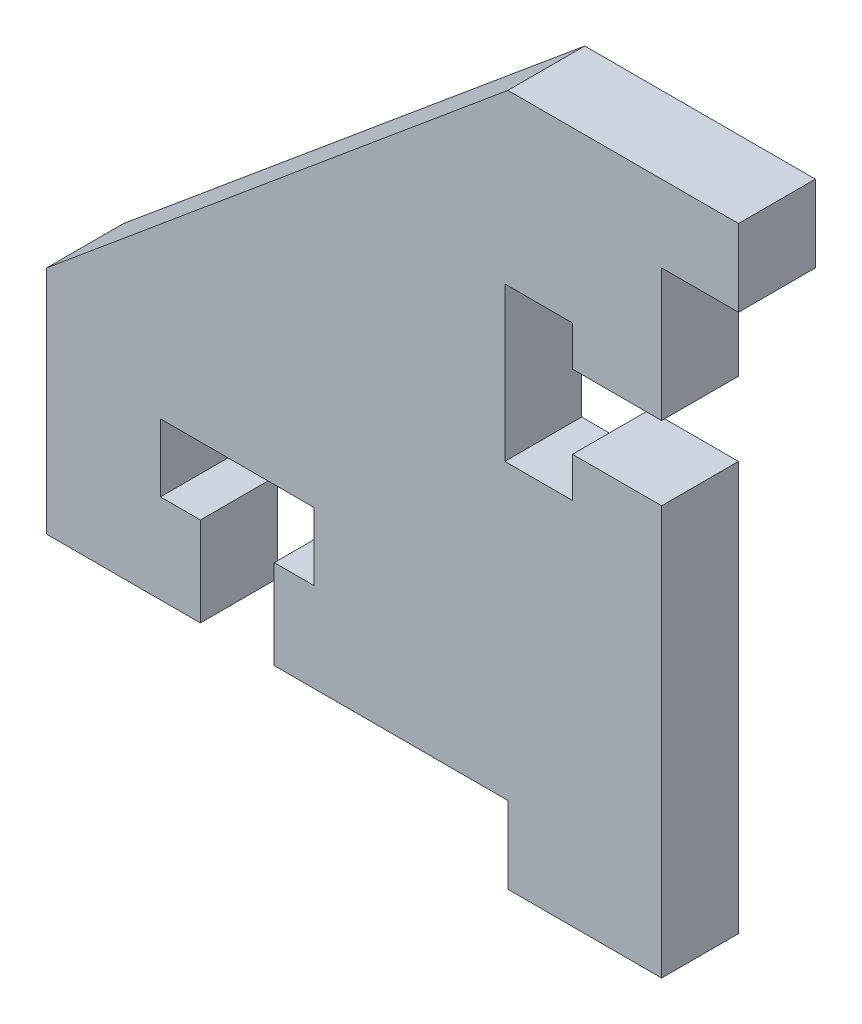
ISO-10303-21;
HEADER;
FILE_DESCRIPTION(('STEP AP214'),'2;1');
FILE_NAME('part.step','',(''),(''),'','','');
FILE_SCHEMA(('AUTOMOTIVE_DESIGN { 1 0 10303 214 1 1 1 1 }'));
ENDSEC;
DATA;
#1=APPLICATION_CONTEXT('core data for automotive mechanical design processes');
#2=APPLICATION_PROTOCOL_DEFINITION('international standard','automotive_design',2000,#1);
#3=PRODUCT_CONTEXT('',#1,'mechanical');
#4=PRODUCT('Part','Part','',(#3));
#5=PRODUCT_RELATED_PRODUCT_CATEGORY('part','',(#4));
#6=PRODUCT_DEFINITION_FORMATION('','',#4);
#7=PRODUCT_DEFINITION_CONTEXT('part definition',#1,'design');
#8=PRODUCT_DEFINITION('design','',#6,#7);
#9=PRODUCT_DEFINITION_SHAPE('','',#8);
#10=(LENGTH_UNIT() NAMED_UNIT(*) SI_UNIT(.MILLI.,.METRE.));
#11=(NAMED_UNIT(*) PLANE_ANGLE_UNIT() SI_UNIT($,.RADIAN.));
#12=(NAMED_UNIT(*) SI_UNIT($,.STERADIAN.) SOLID_ANGLE_UNIT());
#13=UNCERTAINTY_MEASURE_WITH_UNIT(LENGTH_MEASURE(1.E-05),#10,'distance_accuracy_value','');
#14=(GEOMETRIC_REPRESENTATION_CONTEXT(3) GLOBAL_UNCERTAINTY_ASSIGNED_CONTEXT((#13)) GLOBAL_UNIT_ASSIGNED_CONTEXT((#10,
#11,#12)) REPRESENTATION_CONTEXT('',''));
#15=CARTESIAN_POINT('',(0.,0.,0.));
#16=DIRECTION('',(0.,0.,1.));
#17=DIRECTION('',(1.,0.,0.));
#18=AXIS2_PLACEMENT_3D('',#15,#16,#17);
#19=CARTESIAN_POINT('',(-25.4,-4.191,3.175));
#20=DIRECTION('',(0.64018439966448,-0.768221279597376,0.));
#21=DIRECTION('',(0.768221279597376,0.64018439966448,0.));
#22=AXIS2_PLACEMENT_3D('',#19,#20,#21);
#23=PLANE('',#22);
#24=DIRECTION('',(-0.768221279597376,-0.64018439966448,0.));
#25=VECTOR('',#24,1.);
#26=CARTESIAN_POINT('',(-25.4,-4.191,0.));
#27=LINE('',#26,#25);
#28=CARTESIAN_POINT('',(-6.35,11.684,0.));
#29=VERTEX_POINT('',#28);
#30=CARTESIAN_POINT('',(-25.4,-4.191,0.));
#31=VERTEX_POINT('',#30);
#32=EDGE_CURVE('E230',#29,#31,#27,.T.);
#33=ORIENTED_EDGE('',*,*,#32,.T.);
#34=DIRECTION('',(0.,0.,-1.));
#35=VECTOR('',#34,1.);
#36=CARTESIAN_POINT('',(-25.4,-4.191,3.175));
#37=LINE('',#36,#35);
#38=CARTESIAN_POINT('',(-25.4,-4.191,3.175));
#39=VERTEX_POINT('',#38);
#40=EDGE_CURVE('E11',#39,#31,#37,.T.);
#41=ORIENTED_EDGE('',*,*,#40,.F.);
#42=DIRECTION('',(-0.768221279597376,-0.64018439966448,0.));
#43=VECTOR('',#42,1.);
#44=CARTESIAN_POINT('',(-25.4,-4.191,3.175));
#45=LINE('',#44,#43);
#46=CARTESIAN_POINT('',(-6.35,11.684,3.175));
#47=VERTEX_POINT('',#46);
#48=EDGE_CURVE('E278',#47,#39,#45,.T.);
#49=ORIENTED_EDGE('',*,*,#48,.F.);
#50=DIRECTION('',(0.,0.,-1.));
#51=VECTOR('',#50,1.);
#52=CARTESIAN_POINT('',(-6.35,11.684,3.175));
#53=LINE('',#52,#51);
#54=EDGE_CURVE('E226',#47,#29,#53,.T.);
#55=ORIENTED_EDGE('',*,*,#54,.T.);
#56=EDGE_LOOP('',(#33,#41,#49,#55));
#57=FACE_BOUND('',#56,.T.);
#58=ADVANCED_FACE('F32',(#57),#23,.F.);
#59=CARTESIAN_POINT('',(-25.4,-13.716,3.175));
#60=DIRECTION('',(1.,0.,0.));
#61=DIRECTION('',(0.,0.,-1.));
#62=AXIS2_PLACEMENT_3D('',#59,#60,#61);
#63=PLANE('',#62);
#64=DIRECTION('',(0.,-1.,0.));
#65=VECTOR('',#64,1.);
#66=CARTESIAN_POINT('',(-25.4,-13.716,0.));
#67=LINE('',#66,#65);
#68=CARTESIAN_POINT('',(-25.4,-13.716,0.));
#69=VERTEX_POINT('',#68);
#70=EDGE_CURVE('E233',#31,#69,#67,.T.);
#71=ORIENTED_EDGE('',*,*,#70,.T.);
#72=DIRECTION('',(0.,0.,-1.));
#73=VECTOR('',#72,1.);
#74=CARTESIAN_POINT('',(-25.4,-13.716,3.175));
#75=LINE('',#74,#73);
#76=CARTESIAN_POINT('',(-25.4,-13.716,3.175));
#77=VERTEX_POINT('',#76);
#78=EDGE_CURVE('E40',#77,#69,#75,.T.);
#79=ORIENTED_EDGE('',*,*,#78,.F.);
#80=DIRECTION('',(0.,-1.,0.));
#81=VECTOR('',#80,1.);
#82=CARTESIAN_POINT('',(-25.4,-13.716,3.175));
#83=LINE('',#82,#81);
#84=EDGE_CURVE('E142',#39,#77,#83,.T.);
#85=ORIENTED_EDGE('',*,*,#84,.F.);
#86=ORIENTED_EDGE('',*,*,#40,.T.);
#87=EDGE_LOOP('',(#71,#79,#85,#86));
#88=FACE_BOUND('',#87,.T.);
#89=ADVANCED_FACE('F421',(#88),#63,.F.);
#90=CARTESIAN_POINT('',(-19.05,-13.716,3.175));
#91=DIRECTION('',(0.,1.,0.));
#92=DIRECTION('',(-1.,0.,0.));
#93=AXIS2_PLACEMENT_3D('',#90,#91,#92);
#94=PLANE('',#93);
#95=DIRECTION('',(1.,0.,0.));
#96=VECTOR('',#95,1.);
#97=CARTESIAN_POINT('',(-19.05,-13.716,0.));
#98=LINE('',#97,#96);
#99=CARTESIAN_POINT('',(-19.05,-13.716,0.));
#100=VERTEX_POINT('',#99);
#101=EDGE_CURVE('E235',#69,#100,#98,.T.);
#102=ORIENTED_EDGE('',*,*,#101,.T.);
#103=DIRECTION('',(0.,0.,-1.));
#104=VECTOR('',#103,1.);
#105=CARTESIAN_POINT('',(-19.05,-13.716,3.175));
#106=LINE('',#105,#104);
#107=CARTESIAN_POINT('',(-19.05,-13.716,3.175));
#108=VERTEX_POINT('',#107);
#109=EDGE_CURVE('E336',#108,#100,#106,.T.);
#110=ORIENTED_EDGE('',*,*,#109,.F.);
#111=DIRECTION('',(1.,0.,0.));
#112=VECTOR('',#111,1.);
#113=CARTESIAN_POINT('',(-19.05,-13.716,3.175));
#114=LINE('',#113,#112);
#115=EDGE_CURVE('E344',#77,#108,#114,.T.);
#116=ORIENTED_EDGE('',*,*,#115,.F.);
#117=ORIENTED_EDGE('',*,*,#78,.T.);
#118=EDGE_LOOP('',(#102,#110,#116,#117));
#119=FACE_BOUND('',#118,.T.);
#120=ADVANCED_FACE('F342',(#119),#94,.F.);
#121=CARTESIAN_POINT('',(-19.05,-10.033,3.175));
#122=DIRECTION('',(-1.,0.,0.));
#123=DIRECTION('',(0.,0.,1.));
#124=AXIS2_PLACEMENT_3D('',#121,#122,#123);
#125=PLANE('',#124);
#126=DIRECTION('',(0.,1.,0.));
#127=VECTOR('',#126,1.);
#128=CARTESIAN_POINT('',(-19.05,-10.033,0.));
#129=LINE('',#128,#127);
#130=CARTESIAN_POINT('',(-19.05,-10.033,0.));
#131=VERTEX_POINT('',#130);
#132=EDGE_CURVE('E237',#100,#131,#129,.T.);
#133=ORIENTED_EDGE('',*,*,#132,.T.);
#134=DIRECTION('',(0.,0.,-1.));
#135=VECTOR('',#134,1.);
#136=CARTESIAN_POINT('',(-19.05,-10.033,3.175));
#137=LINE('',#136,#135);
#138=CARTESIAN_POINT('',(-19.05,-10.033,3.175));
#139=VERTEX_POINT('',#138);
#140=EDGE_CURVE('E333',#139,#131,#137,.T.);
#141=ORIENTED_EDGE('',*,*,#140,.F.);
#142=DIRECTION('',(0.,1.,0.));
#143=VECTOR('',#142,1.);
#144=CARTESIAN_POINT('',(-19.05,-10.033,3.175));
#145=LINE('',#144,#143);
#146=EDGE_CURVE('E362',#108,#139,#145,.T.);
#147=ORIENTED_EDGE('',*,*,#146,.F.);
#148=ORIENTED_EDGE('',*,*,#109,.T.);
#149=EDGE_LOOP('',(#133,#141,#147,#148));
#150=FACE_BOUND('',#149,.T.);
#151=ADVANCED_FACE('F353',(#150),#125,.F.);
#152=CARTESIAN_POINT('',(-20.701,-10.033,3.175));
#153=DIRECTION('',(0.,-1.,0.));
#154=DIRECTION('',(0.,0.,-1.));
#155=AXIS2_PLACEMENT_3D('',#152,#153,#154);
#156=PLANE('',#155);
#157=DIRECTION('',(-1.,0.,0.));
#158=VECTOR('',#157,1.);
#159=CARTESIAN_POINT('',(-20.701,-10.033,0.));
#160=LINE('',#159,#158);
#161=CARTESIAN_POINT('',(-20.701,-10.033,0.));
#162=VERTEX_POINT('',#161);
#163=EDGE_CURVE('E239',#131,#162,#160,.T.);
#164=ORIENTED_EDGE('',*,*,#163,.T.);
#165=DIRECTION('',(0.,0.,-1.));
#166=VECTOR('',#165,1.);
#167=CARTESIAN_POINT('',(-20.701,-10.033,3.175));
#168=LINE('',#167,#166);
#169=CARTESIAN_POINT('',(-20.701,-10.033,3.175));
#170=VERTEX_POINT('',#169);
#171=EDGE_CURVE('E330',#170,#162,#168,.T.);
#172=ORIENTED_EDGE('',*,*,#171,.F.);
#173=DIRECTION('',(-1.,0.,0.));
#174=VECTOR('',#173,1.);
#175=CARTESIAN_POINT('',(-20.701,-10.033,3.175));
#176=LINE('',#175,#174);
#177=EDGE_CURVE('E359',#139,#170,#176,.T.);
#178=ORIENTED_EDGE('',*,*,#177,.F.);
#179=ORIENTED_EDGE('',*,*,#140,.T.);
#180=EDGE_LOOP('',(#164,#172,#178,#179));
#181=FACE_BOUND('',#180,.T.);
#182=ADVANCED_FACE('F357',(#181),#156,.F.);
#183=CARTESIAN_POINT('',(-20.701,-7.23900000000001,3.175));
#184=DIRECTION('',(-1.,0.,0.));
#185=DIRECTION('',(0.,0.,1.));
#186=AXIS2_PLACEMENT_3D('',#183,#184,#185);
#187=PLANE('',#186);
#188=DIRECTION('',(0.,1.,0.));
#189=VECTOR('',#188,1.);
#190=CARTESIAN_POINT('',(-20.701,-7.23900000000001,0.));
#191=LINE('',#190,#189);
#192=CARTESIAN_POINT('',(-20.701,-7.23900000000001,0.));
#193=VERTEX_POINT('',#192);
#194=EDGE_CURVE('E241',#162,#193,#191,.T.);
#195=ORIENTED_EDGE('',*,*,#194,.T.);
#196=DIRECTION('',(0.,0.,-1.));
#197=VECTOR('',#196,1.);
#198=CARTESIAN_POINT('',(-20.701,-7.23900000000001,3.175));
#199=LINE('',#198,#197);
#200=CARTESIAN_POINT('',(-20.701,-7.23900000000001,3.175));
#201=VERTEX_POINT('',#200);
#202=EDGE_CURVE('E327',#201,#193,#199,.T.);
#203=ORIENTED_EDGE('',*,*,#202,.F.);
#204=DIRECTION('',(0.,1.,0.));
#205=VECTOR('',#204,1.);
#206=CARTESIAN_POINT('',(-20.701,-7.23900000000001,3.175));
#207=LINE('',#206,#205);
#208=EDGE_CURVE('E361',#170,#201,#207,.T.);
#209=ORIENTED_EDGE('',*,*,#208,.F.);
#210=ORIENTED_EDGE('',*,*,#171,.T.);
#211=EDGE_LOOP('',(#195,#203,#209,#210));
#212=FACE_BOUND('',#211,.T.);
#213=ADVANCED_FACE('F434',(#212),#187,.F.);
#214=CARTESIAN_POINT('',(-14.351,-7.239,3.175));
#215=DIRECTION('',(0.,1.,0.));
#216=DIRECTION('',(-1.,0.,0.));
#217=AXIS2_PLACEMENT_3D('',#214,#215,#216);
#218=PLANE('',#217);
#219=DIRECTION('',(1.,0.,0.));
#220=VECTOR('',#219,1.);
#221=CARTESIAN_POINT('',(-14.351,-7.239,0.));
#222=LINE('',#221,#220);
#223=CARTESIAN_POINT('',(-14.351,-7.239,0.));
#224=VERTEX_POINT('',#223);
#225=EDGE_CURVE('E243',#193,#224,#222,.T.);
#226=ORIENTED_EDGE('',*,*,#225,.T.);
#227=DIRECTION('',(0.,0.,-1.));
#228=VECTOR('',#227,1.);
#229=CARTESIAN_POINT('',(-14.351,-7.239,3.175));
#230=LINE('',#229,#228);
#231=CARTESIAN_POINT('',(-14.351,-7.239,3.175));
#232=VERTEX_POINT('',#231);
#233=EDGE_CURVE('E324',#232,#224,#230,.T.);
#234=ORIENTED_EDGE('',*,*,#233,.F.);
#235=DIRECTION('',(1.,0.,0.));
#236=VECTOR('',#235,1.);
#237=CARTESIAN_POINT('',(-14.351,-7.239,3.175));
#238=LINE('',#237,#236);
#239=EDGE_CURVE('E364',#201,#232,#238,.T.);
#240=ORIENTED_EDGE('',*,*,#239,.F.);
#241=ORIENTED_EDGE('',*,*,#202,.T.);
#242=EDGE_LOOP('',(#226,#234,#240,#241));
#243=FACE_BOUND('',#242,.T.);
#244=ADVANCED_FACE('F437',(#243),#218,.F.);
#245=CARTESIAN_POINT('',(-14.351,-10.033,3.175));
#246=DIRECTION('',(1.,0.,0.));
#247=DIRECTION('',(0.,0.,-1.));
#248=AXIS2_PLACEMENT_3D('',#245,#246,#247);
#249=PLANE('',#248);
#250=DIRECTION('',(0.,-1.,0.));
#251=VECTOR('',#250,1.);
#252=CARTESIAN_POINT('',(-14.351,-10.033,0.));
#253=LINE('',#252,#251);
#254=CARTESIAN_POINT('',(-14.351,-10.033,0.));
#255=VERTEX_POINT('',#254);
#256=EDGE_CURVE('E245',#224,#255,#253,.T.);
#257=ORIENTED_EDGE('',*,*,#256,.T.);
#258=DIRECTION('',(0.,0.,-1.));
#259=VECTOR('',#258,1.);
#260=CARTESIAN_POINT('',(-14.351,-10.033,3.175));
#261=LINE('',#260,#259);
#262=CARTESIAN_POINT('',(-14.351,-10.033,3.175));
#263=VERTEX_POINT('',#262);
#264=EDGE_CURVE('E321',#263,#255,#261,.T.);
#265=ORIENTED_EDGE('',*,*,#264,.F.);
#266=DIRECTION('',(0.,-1.,0.));
#267=VECTOR('',#266,1.);
#268=CARTESIAN_POINT('',(-14.351,-10.033,3.175));
#269=LINE('',#268,#267);
#270=EDGE_CURVE('E370',#232,#263,#269,.T.);
#271=ORIENTED_EDGE('',*,*,#270,.F.);
#272=ORIENTED_EDGE('',*,*,#233,.T.);
#273=EDGE_LOOP('',(#257,#265,#271,#272));
#274=FACE_BOUND('',#273,.T.);
#275=ADVANCED_FACE('F441',(#274),#249,.F.);
#276=CARTESIAN_POINT('',(-16.002,-10.033,3.175));
#277=DIRECTION('',(0.,-1.,0.));
#278=DIRECTION('',(0.,0.,-1.));
#279=AXIS2_PLACEMENT_3D('',#276,#277,#278);
#280=PLANE('',#279);
#281=DIRECTION('',(-1.,0.,0.));
#282=VECTOR('',#281,1.);
#283=CARTESIAN_POINT('',(-16.002,-10.033,0.));
#284=LINE('',#283,#282);
#285=CARTESIAN_POINT('',(-16.002,-10.033,0.));
#286=VERTEX_POINT('',#285);
#287=EDGE_CURVE('E247',#255,#286,#284,.T.);
#288=ORIENTED_EDGE('',*,*,#287,.T.);
#289=DIRECTION('',(0.,0.,-1.));
#290=VECTOR('',#289,1.);
#291=CARTESIAN_POINT('',(-16.002,-10.033,3.175));
#292=LINE('',#291,#290);
#293=CARTESIAN_POINT('',(-16.002,-10.033,3.175));
#294=VERTEX_POINT('',#293);
#295=EDGE_CURVE('E318',#294,#286,#292,.T.);
#296=ORIENTED_EDGE('',*,*,#295,.F.);
#297=DIRECTION('',(-1.,0.,0.));
#298=VECTOR('',#297,1.);
#299=CARTESIAN_POINT('',(-16.002,-10.033,3.175));
#300=LINE('',#299,#298);
#301=EDGE_CURVE('E372',#263,#294,#300,.T.);
#302=ORIENTED_EDGE('',*,*,#301,.F.);
#303=ORIENTED_EDGE('',*,*,#264,.T.);
#304=EDGE_LOOP('',(#288,#296,#302,#303));
#305=FACE_BOUND('',#304,.T.);
#306=ADVANCED_FACE('F445',(#305),#280,.F.);
#307=CARTESIAN_POINT('',(-16.002,-10.033,3.175));
#308=DIRECTION('',(1.,0.,0.));
#309=DIRECTION('',(0.,1.,0.));
#310=AXIS2_PLACEMENT_3D('',#307,#308,#309);
#311=PLANE('',#310);
#312=DIRECTION('',(0.,-1.,0.));
#313=VECTOR('',#312,1.);
#314=CARTESIAN_POINT('',(-16.002,-10.033,0.));
#315=LINE('',#314,#313);
#316=CARTESIAN_POINT('',(-16.002,-13.716,0.));
#317=VERTEX_POINT('',#316);
#318=EDGE_CURVE('E249',#286,#317,#315,.T.);
#319=ORIENTED_EDGE('',*,*,#318,.T.);
#320=DIRECTION('',(0.,0.,-1.));
#321=VECTOR('',#320,1.);
#322=CARTESIAN_POINT('',(-16.002,-13.716,3.175));
#323=LINE('',#322,#321);
#324=CARTESIAN_POINT('',(-16.002,-13.716,3.175));
#325=VERTEX_POINT('',#324);
#326=EDGE_CURVE('E315',#325,#317,#323,.T.);
#327=ORIENTED_EDGE('',*,*,#326,.F.);
#328=DIRECTION('',(0.,-1.,0.));
#329=VECTOR('',#328,1.);
#330=CARTESIAN_POINT('',(-16.002,-10.033,3.175));
#331=LINE('',#330,#329);
#332=EDGE_CURVE('E374',#294,#325,#331,.T.);
#333=ORIENTED_EDGE('',*,*,#332,.F.);
#334=ORIENTED_EDGE('',*,*,#295,.T.);
#335=EDGE_LOOP('',(#319,#327,#333,#334));
#336=FACE_BOUND('',#335,.T.);
#337=ADVANCED_FACE('F449',(#336),#311,.F.);
#338=CARTESIAN_POINT('',(-6.35,-13.716,3.175));
#339=DIRECTION('',(0.,1.,0.));
#340=DIRECTION('',(-1.,0.,0.));
#341=AXIS2_PLACEMENT_3D('',#338,#339,#340);
#342=PLANE('',#341);
#343=DIRECTION('',(1.,0.,0.));
#344=VECTOR('',#343,1.);
#345=CARTESIAN_POINT('',(-6.35,-13.716,0.));
#346=LINE('',#345,#344);
#347=CARTESIAN_POINT('',(-6.35,-13.716,0.));
#348=VERTEX_POINT('',#347);
#349=EDGE_CURVE('E251',#317,#348,#346,.T.);
#350=ORIENTED_EDGE('',*,*,#349,.T.);
#351=DIRECTION('',(0.,0.,-1.));
#352=VECTOR('',#351,1.);
#353=CARTESIAN_POINT('',(-6.35,-13.716,3.175));
#354=LINE('',#353,#352);
#355=CARTESIAN_POINT('',(-6.35,-13.716,3.175));
#356=VERTEX_POINT('',#355);
#357=EDGE_CURVE('E312',#356,#348,#354,.T.);
#358=ORIENTED_EDGE('',*,*,#357,.F.);
#359=DIRECTION('',(1.,0.,0.));
#360=VECTOR('',#359,1.);
#361=CARTESIAN_POINT('',(-6.35,-13.716,3.175));
#362=LINE('',#361,#360);
#363=EDGE_CURVE('E376',#325,#356,#362,.T.);
#364=ORIENTED_EDGE('',*,*,#363,.F.);
#365=ORIENTED_EDGE('',*,*,#326,.T.);
#366=EDGE_LOOP('',(#350,#358,#364,#365));
#367=FACE_BOUND('',#366,.T.);
#368=ADVANCED_FACE('F453',(#367),#342,.F.);
#369=CARTESIAN_POINT('',(-6.35,-16.891,3.175));
#370=DIRECTION('',(1.,0.,0.));
#371=DIRECTION('',(0.,1.,0.));
#372=AXIS2_PLACEMENT_3D('',#369,#370,#371);
#373=PLANE('',#372);
#374=DIRECTION('',(0.,-1.,0.));
#375=VECTOR('',#374,1.);
#376=CARTESIAN_POINT('',(-6.35,-16.891,0.));
#377=LINE('',#376,#375);
#378=CARTESIAN_POINT('',(-6.35,-16.891,0.));
#379=VERTEX_POINT('',#378);
#380=EDGE_CURVE('E253',#348,#379,#377,.T.);
#381=ORIENTED_EDGE('',*,*,#380,.T.);
#382=DIRECTION('',(0.,0.,-1.));
#383=VECTOR('',#382,1.);
#384=CARTESIAN_POINT('',(-6.35,-16.891,3.175));
#385=LINE('',#384,#383);
#386=CARTESIAN_POINT('',(-6.35,-16.891,3.175));
#387=VERTEX_POINT('',#386);
#388=EDGE_CURVE('E309',#387,#379,#385,.T.);
#389=ORIENTED_EDGE('',*,*,#388,.F.);
#390=DIRECTION('',(0.,-1.,0.));
#391=VECTOR('',#390,1.);
#392=CARTESIAN_POINT('',(-6.35,-16.891,3.175));
#393=LINE('',#392,#391);
#394=EDGE_CURVE('E378',#356,#387,#393,.T.);
#395=ORIENTED_EDGE('',*,*,#394,.F.);
#396=ORIENTED_EDGE('',*,*,#357,.T.);
#397=EDGE_LOOP('',(#381,#389,#395,#396));
#398=FACE_BOUND('',#397,.T.);
#399=ADVANCED_FACE('F457',(#398),#373,.F.);
#400=CARTESIAN_POINT('',(0.,-16.891,3.175));
#401=DIRECTION('',(0.,1.,0.));
#402=DIRECTION('',(0.,0.,1.));
#403=AXIS2_PLACEMENT_3D('',#400,#401,#402);
#404=PLANE('',#403);
#405=DIRECTION('',(1.,0.,0.));
#406=VECTOR('',#405,1.);
#407=CARTESIAN_POINT('',(0.,-16.891,0.));
#408=LINE('',#407,#406);
#409=CARTESIAN_POINT('',(0.,-16.891,0.));
#410=VERTEX_POINT('',#409);
#411=EDGE_CURVE('E255',#379,#410,#408,.T.);
#412=ORIENTED_EDGE('',*,*,#411,.T.);
#413=DIRECTION('',(0.,0.,-1.));
#414=VECTOR('',#413,1.);
#415=CARTESIAN_POINT('',(0.,-16.891,3.175));
#416=LINE('',#415,#414);
#417=CARTESIAN_POINT('',(0.,-16.891,3.175));
#418=VERTEX_POINT('',#417);
#419=EDGE_CURVE('E306',#418,#410,#416,.T.);
#420=ORIENTED_EDGE('',*,*,#419,.F.);
#421=DIRECTION('',(1.,0.,0.));
#422=VECTOR('',#421,1.);
#423=CARTESIAN_POINT('',(0.,-16.891,3.175));
#424=LINE('',#423,#422);
#425=EDGE_CURVE('E380',#387,#418,#424,.T.);
#426=ORIENTED_EDGE('',*,*,#425,.F.);
#427=ORIENTED_EDGE('',*,*,#388,.T.);
#428=EDGE_LOOP('',(#412,#420,#426,#427));
#429=FACE_BOUND('',#428,.T.);
#430=ADVANCED_FACE('F461',(#429),#404,.F.);
#431=CARTESIAN_POINT('',(0.,0.,3.175));
#432=DIRECTION('',(-1.,0.,0.));
#433=DIRECTION('',(0.,-1.,0.));
#434=AXIS2_PLACEMENT_3D('',#431,#432,#433);
#435=PLANE('',#434);
#436=DIRECTION('',(0.,1.,0.));
#437=VECTOR('',#436,1.);
#438=CARTESIAN_POINT('',(0.,0.,0.));
#439=LINE('',#438,#437);
#440=CARTESIAN_POINT('',(0.,0.,0.));
#441=VERTEX_POINT('',#440);
#442=EDGE_CURVE('E257',#410,#441,#439,.T.);
#443=ORIENTED_EDGE('',*,*,#442,.T.);
#444=DIRECTION('',(0.,0.,-1.));
#445=VECTOR('',#444,1.);
#446=CARTESIAN_POINT('',(0.,0.,3.175));
#447=LINE('',#446,#445);
#448=CARTESIAN_POINT('',(0.,0.,3.175));
#449=VERTEX_POINT('',#448);
#450=EDGE_CURVE('E303',#449,#441,#447,.T.);
#451=ORIENTED_EDGE('',*,*,#450,.F.);
#452=DIRECTION('',(0.,1.,0.));
#453=VECTOR('',#452,1.);
#454=CARTESIAN_POINT('',(0.,0.,3.175));
#455=LINE('',#454,#453);
#456=EDGE_CURVE('E382',#418,#449,#455,.T.);
#457=ORIENTED_EDGE('',*,*,#456,.F.);
#458=ORIENTED_EDGE('',*,*,#419,.T.);
#459=EDGE_LOOP('',(#443,#451,#457,#458));
#460=FACE_BOUND('',#459,.T.);
#461=ADVANCED_FACE('F465',(#460),#435,.F.);
#462=CARTESIAN_POINT('',(-3.683,0.,3.175));
#463=DIRECTION('',(0.,-1.,0.));
#464=DIRECTION('',(0.,0.,-1.));
#465=AXIS2_PLACEMENT_3D('',#462,#463,#464);
#466=PLANE('',#465);
#467=DIRECTION('',(-1.,0.,0.));
#468=VECTOR('',#467,1.);
#469=CARTESIAN_POINT('',(-3.683,0.,0.));
#470=LINE('',#469,#468);
#471=CARTESIAN_POINT('',(-3.683,0.,0.));
#472=VERTEX_POINT('',#471);
#473=EDGE_CURVE('E259',#441,#472,#470,.T.);
#474=ORIENTED_EDGE('',*,*,#473,.T.);
#475=DIRECTION('',(0.,0.,-1.));
#476=VECTOR('',#475,1.);
#477=CARTESIAN_POINT('',(-3.683,0.,3.175));
#478=LINE('',#477,#476);
#479=CARTESIAN_POINT('',(-3.683,0.,3.175));
#480=VERTEX_POINT('',#479);
#481=EDGE_CURVE('E300',#480,#472,#478,.T.);
#482=ORIENTED_EDGE('',*,*,#481,.F.);
#483=DIRECTION('',(-1.,0.,0.));
#484=VECTOR('',#483,1.);
#485=CARTESIAN_POINT('',(-3.683,0.,3.175));
#486=LINE('',#485,#484);
#487=EDGE_CURVE('E384',#449,#480,#486,.T.);
#488=ORIENTED_EDGE('',*,*,#487,.F.);
#489=ORIENTED_EDGE('',*,*,#450,.T.);
#490=EDGE_LOOP('',(#474,#482,#488,#489));
#491=FACE_BOUND('',#490,.T.);
#492=ADVANCED_FACE('F469',(#491),#466,.F.);
#493=CARTESIAN_POINT('',(-3.683,-1.651,3.175));
#494=DIRECTION('',(1.,0.,0.));
#495=DIRECTION('',(0.,0.,-1.));
#496=AXIS2_PLACEMENT_3D('',#493,#494,#495);
#497=PLANE('',#496);
#498=DIRECTION('',(0.,-1.,0.));
#499=VECTOR('',#498,1.);
#500=CARTESIAN_POINT('',(-3.683,-1.651,0.));
#501=LINE('',#500,#499);
#502=CARTESIAN_POINT('',(-3.683,-1.651,0.));
#503=VERTEX_POINT('',#502);
#504=EDGE_CURVE('E261',#472,#503,#501,.T.);
#505=ORIENTED_EDGE('',*,*,#504,.T.);
#506=DIRECTION('',(0.,0.,-1.));
#507=VECTOR('',#506,1.);
#508=CARTESIAN_POINT('',(-3.683,-1.651,3.175));
#509=LINE('',#508,#507);
#510=CARTESIAN_POINT('',(-3.683,-1.651,3.175));
#511=VERTEX_POINT('',#510);
#512=EDGE_CURVE('E297',#511,#503,#509,.T.);
#513=ORIENTED_EDGE('',*,*,#512,.F.);
#514=DIRECTION('',(0.,-1.,0.));
#515=VECTOR('',#514,1.);
#516=CARTESIAN_POINT('',(-3.683,-1.651,3.175));
#517=LINE('',#516,#515);
#518=EDGE_CURVE('E386',#480,#511,#517,.T.);
#519=ORIENTED_EDGE('',*,*,#518,.F.);
#520=ORIENTED_EDGE('',*,*,#481,.T.);
#521=EDGE_LOOP('',(#505,#513,#519,#520));
#522=FACE_BOUND('',#521,.T.);
#523=ADVANCED_FACE('F473',(#522),#497,.F.);
#524=CARTESIAN_POINT('',(-6.477,-1.651,3.175));
#525=DIRECTION('',(0.,-1.,0.));
#526=DIRECTION('',(0.,0.,-1.));
#527=AXIS2_PLACEMENT_3D('',#524,#525,#526);
#528=PLANE('',#527);
#529=DIRECTION('',(-1.,0.,0.));
#530=VECTOR('',#529,1.);
#531=CARTESIAN_POINT('',(-6.477,-1.651,0.));
#532=LINE('',#531,#530);
#533=CARTESIAN_POINT('',(-6.477,-1.651,0.));
#534=VERTEX_POINT('',#533);
#535=EDGE_CURVE('E263',#503,#534,#532,.T.);
#536=ORIENTED_EDGE('',*,*,#535,.T.);
#537=DIRECTION('',(0.,0.,-1.));
#538=VECTOR('',#537,1.);
#539=CARTESIAN_POINT('',(-6.477,-1.651,3.175));
#540=LINE('',#539,#538);
#541=CARTESIAN_POINT('',(-6.477,-1.651,3.175));
#542=VERTEX_POINT('',#541);
#543=EDGE_CURVE('E294',#542,#534,#540,.T.);
#544=ORIENTED_EDGE('',*,*,#543,.F.);
#545=DIRECTION('',(-1.,0.,0.));
#546=VECTOR('',#545,1.);
#547=CARTESIAN_POINT('',(-6.477,-1.651,3.175));
#548=LINE('',#547,#546);
#549=EDGE_CURVE('E388',#511,#542,#548,.T.);
#550=ORIENTED_EDGE('',*,*,#549,.F.);
#551=ORIENTED_EDGE('',*,*,#512,.T.);
#552=EDGE_LOOP('',(#536,#544,#550,#551));
#553=FACE_BOUND('',#552,.T.);
#554=ADVANCED_FACE('F477',(#553),#528,.F.);
#555=CARTESIAN_POINT('',(-6.477,4.699,3.175));
#556=DIRECTION('',(-1.,0.,0.));
#557=DIRECTION('',(0.,0.,1.));
#558=AXIS2_PLACEMENT_3D('',#555,#556,#557);
#559=PLANE('',#558);
#560=DIRECTION('',(0.,1.,0.));
#561=VECTOR('',#560,1.);
#562=CARTESIAN_POINT('',(-6.477,4.699,0.));
#563=LINE('',#562,#561);
#564=CARTESIAN_POINT('',(-6.477,4.699,0.));
#565=VERTEX_POINT('',#564);
#566=EDGE_CURVE('E265',#534,#565,#563,.T.);
#567=ORIENTED_EDGE('',*,*,#566,.T.);
#568=DIRECTION('',(0.,0.,-1.));
#569=VECTOR('',#568,1.);
#570=CARTESIAN_POINT('',(-6.477,4.699,3.175));
#571=LINE('',#570,#569);
#572=CARTESIAN_POINT('',(-6.477,4.699,3.175));
#573=VERTEX_POINT('',#572);
#574=EDGE_CURVE('E291',#573,#565,#571,.T.);
#575=ORIENTED_EDGE('',*,*,#574,.F.);
#576=DIRECTION('',(0.,1.,0.));
#577=VECTOR('',#576,1.);
#578=CARTESIAN_POINT('',(-6.477,4.699,3.175));
#579=LINE('',#578,#577);
#580=EDGE_CURVE('E390',#542,#573,#579,.T.);
#581=ORIENTED_EDGE('',*,*,#580,.F.);
#582=ORIENTED_EDGE('',*,*,#543,.T.);
#583=EDGE_LOOP('',(#567,#575,#581,#582));
#584=FACE_BOUND('',#583,.T.);
#585=ADVANCED_FACE('F481',(#584),#559,.F.);
#586=CARTESIAN_POINT('',(-3.683,4.699,3.175));
#587=DIRECTION('',(0.,1.,0.));
#588=DIRECTION('',(0.,0.,1.));
#589=AXIS2_PLACEMENT_3D('',#586,#587,#588);
#590=PLANE('',#589);
#591=DIRECTION('',(1.,0.,0.));
#592=VECTOR('',#591,1.);
#593=CARTESIAN_POINT('',(-3.683,4.699,0.));
#594=LINE('',#593,#592);
#595=CARTESIAN_POINT('',(-3.683,4.699,0.));
#596=VERTEX_POINT('',#595);
#597=EDGE_CURVE('E267',#565,#596,#594,.T.);
#598=ORIENTED_EDGE('',*,*,#597,.T.);
#599=DIRECTION('',(0.,0.,-1.));
#600=VECTOR('',#599,1.);
#601=CARTESIAN_POINT('',(-3.683,4.699,3.175));
#602=LINE('',#601,#600);
#603=CARTESIAN_POINT('',(-3.683,4.699,3.175));
#604=VERTEX_POINT('',#603);
#605=EDGE_CURVE('E288',#604,#596,#602,.T.);
#606=ORIENTED_EDGE('',*,*,#605,.F.);
#607=DIRECTION('',(1.,0.,0.));
#608=VECTOR('',#607,1.);
#609=CARTESIAN_POINT('',(-3.683,4.699,3.175));
#610=LINE('',#609,#608);
#611=EDGE_CURVE('E392',#573,#604,#610,.T.);
#612=ORIENTED_EDGE('',*,*,#611,.F.);
#613=ORIENTED_EDGE('',*,*,#574,.T.);
#614=EDGE_LOOP('',(#598,#606,#612,#613));
#615=FACE_BOUND('',#614,.T.);
#616=ADVANCED_FACE('F485',(#615),#590,.F.);
#617=CARTESIAN_POINT('',(-3.683,3.048,3.175));
#618=DIRECTION('',(1.,0.,0.));
#619=DIRECTION('',(0.,0.,-1.));
#620=AXIS2_PLACEMENT_3D('',#617,#618,#619);
#621=PLANE('',#620);
#622=DIRECTION('',(0.,-1.,0.));
#623=VECTOR('',#622,1.);
#624=CARTESIAN_POINT('',(-3.683,3.048,0.));
#625=LINE('',#624,#623);
#626=CARTESIAN_POINT('',(-3.683,3.048,0.));
#627=VERTEX_POINT('',#626);
#628=EDGE_CURVE('E269',#596,#627,#625,.T.);
#629=ORIENTED_EDGE('',*,*,#628,.T.);
#630=DIRECTION('',(0.,0.,-1.));
#631=VECTOR('',#630,1.);
#632=CARTESIAN_POINT('',(-3.683,3.048,3.175));
#633=LINE('',#632,#631);
#634=CARTESIAN_POINT('',(-3.683,3.048,3.175));
#635=VERTEX_POINT('',#634);
#636=EDGE_CURVE('E285',#635,#627,#633,.T.);
#637=ORIENTED_EDGE('',*,*,#636,.F.);
#638=DIRECTION('',(0.,-1.,0.));
#639=VECTOR('',#638,1.);
#640=CARTESIAN_POINT('',(-3.683,3.048,3.175));
#641=LINE('',#640,#639);
#642=EDGE_CURVE('E394',#604,#635,#641,.T.);
#643=ORIENTED_EDGE('',*,*,#642,.F.);
#644=ORIENTED_EDGE('',*,*,#605,.T.);
#645=EDGE_LOOP('',(#629,#637,#643,#644));
#646=FACE_BOUND('',#645,.T.);
#647=ADVANCED_FACE('F489',(#646),#621,.F.);
#648=CARTESIAN_POINT('',(0.,3.048,3.175));
#649=DIRECTION('',(0.,1.,0.));
#650=DIRECTION('',(0.,0.,1.));
#651=AXIS2_PLACEMENT_3D('',#648,#649,#650);
#652=PLANE('',#651);
#653=DIRECTION('',(1.,0.,0.));
#654=VECTOR('',#653,1.);
#655=CARTESIAN_POINT('',(0.,3.048,0.));
#656=LINE('',#655,#654);
#657=CARTESIAN_POINT('',(0.,3.048,0.));
#658=VERTEX_POINT('',#657);
#659=EDGE_CURVE('E271',#627,#658,#656,.T.);
#660=ORIENTED_EDGE('',*,*,#659,.T.);
#661=DIRECTION('',(0.,0.,-1.));
#662=VECTOR('',#661,1.);
#663=CARTESIAN_POINT('',(0.,3.048,3.175));
#664=LINE('',#663,#662);
#665=CARTESIAN_POINT('',(0.,3.048,3.175));
#666=VERTEX_POINT('',#665);
#667=EDGE_CURVE('E282',#666,#658,#664,.T.);
#668=ORIENTED_EDGE('',*,*,#667,.F.);
#669=DIRECTION('',(1.,0.,0.));
#670=VECTOR('',#669,1.);
#671=CARTESIAN_POINT('',(0.,3.048,3.175));
#672=LINE('',#671,#670);
#673=EDGE_CURVE('E396',#635,#666,#672,.T.);
#674=ORIENTED_EDGE('',*,*,#673,.F.);
#675=ORIENTED_EDGE('',*,*,#636,.T.);
#676=EDGE_LOOP('',(#660,#668,#674,#675));
#677=FACE_BOUND('',#676,.T.);
#678=ADVANCED_FACE('F402',(#677),#652,.F.);
#679=CARTESIAN_POINT('',(0.,8.509,3.175));
#680=DIRECTION('',(-1.,0.,0.));
#681=DIRECTION('',(0.,-1.,0.));
#682=AXIS2_PLACEMENT_3D('',#679,#680,#681);
#683=PLANE('',#682);
#684=DIRECTION('',(0.,1.,0.));
#685=VECTOR('',#684,1.);
#686=CARTESIAN_POINT('',(0.,8.509,0.));
#687=LINE('',#686,#685);
#688=CARTESIAN_POINT('',(0.,8.509,0.));
#689=VERTEX_POINT('',#688);
#690=EDGE_CURVE('E273',#658,#689,#687,.T.);
#691=ORIENTED_EDGE('',*,*,#690,.T.);
#692=DIRECTION('',(0.,0.,-1.));
#693=VECTOR('',#692,1.);
#694=CARTESIAN_POINT('',(0.,8.509,3.175));
#695=LINE('',#694,#693);
#696=CARTESIAN_POINT('',(0.,8.509,3.175));
#697=VERTEX_POINT('',#696);
#698=EDGE_CURVE('E221',#697,#689,#695,.T.);
#699=ORIENTED_EDGE('',*,*,#698,.F.);
#700=DIRECTION('',(0.,1.,0.));
#701=VECTOR('',#700,1.);
#702=CARTESIAN_POINT('',(0.,8.509,3.175));
#703=LINE('',#702,#701);
#704=EDGE_CURVE('E212',#666,#697,#703,.T.);
#705=ORIENTED_EDGE('',*,*,#704,.F.);
#706=ORIENTED_EDGE('',*,*,#667,.T.);
#707=EDGE_LOOP('',(#691,#699,#705,#706));
#708=FACE_BOUND('',#707,.T.);
#709=ADVANCED_FACE('F406',(#708),#683,.F.);
#710=CARTESIAN_POINT('',(3.175,8.509,3.175));
#711=DIRECTION('',(0.,1.,0.));
#712=DIRECTION('',(0.,0.,1.));
#713=AXIS2_PLACEMENT_3D('',#710,#711,#712);
#714=PLANE('',#713);
#715=DIRECTION('',(1.,0.,0.));
#716=VECTOR('',#715,1.);
#717=CARTESIAN_POINT('',(3.175,8.509,0.));
#718=LINE('',#717,#716);
#719=CARTESIAN_POINT('',(3.175,8.509,0.));
#720=VERTEX_POINT('',#719);
#721=EDGE_CURVE('E220',#689,#720,#718,.T.);
#722=ORIENTED_EDGE('',*,*,#721,.T.);
#723=DIRECTION('',(0.,0.,-1.));
#724=VECTOR('',#723,1.);
#725=CARTESIAN_POINT('',(3.175,8.509,3.175));
#726=LINE('',#725,#724);
#727=CARTESIAN_POINT('',(3.175,8.509,3.175));
#728=VERTEX_POINT('',#727);
#729=EDGE_CURVE('E217',#728,#720,#726,.T.);
#730=ORIENTED_EDGE('',*,*,#729,.F.);
#731=DIRECTION('',(1.,0.,0.));
#732=VECTOR('',#731,1.);
#733=CARTESIAN_POINT('',(3.175,8.509,3.175));
#734=LINE('',#733,#732);
#735=EDGE_CURVE('E206',#697,#728,#734,.T.);
#736=ORIENTED_EDGE('',*,*,#735,.F.);
#737=ORIENTED_EDGE('',*,*,#698,.T.);
#738=EDGE_LOOP('',(#722,#730,#736,#737));
#739=FACE_BOUND('',#738,.T.);
#740=ADVANCED_FACE('F218',(#739),#714,.F.);
#741=CARTESIAN_POINT('',(3.175,11.684,3.175));
#742=DIRECTION('',(-1.,0.,0.));
#743=DIRECTION('',(0.,-1.,0.));
#744=AXIS2_PLACEMENT_3D('',#741,#742,#743);
#745=PLANE('',#744);
#746=DIRECTION('',(0.,1.,0.));
#747=VECTOR('',#746,1.);
#748=CARTESIAN_POINT('',(3.175,11.684,0.));
#749=LINE('',#748,#747);
#750=CARTESIAN_POINT('',(3.175,11.684,0.));
#751=VERTEX_POINT('',#750);
#752=EDGE_CURVE('E128',#720,#751,#749,.T.);
#753=ORIENTED_EDGE('',*,*,#752,.T.);
#754=DIRECTION('',(0.,0.,-1.));
#755=VECTOR('',#754,1.);
#756=CARTESIAN_POINT('',(3.175,11.684,3.175));
#757=LINE('',#756,#755);
#758=CARTESIAN_POINT('',(3.175,11.684,3.175));
#759=VERTEX_POINT('',#758);
#760=EDGE_CURVE('E222',#759,#751,#757,.T.);
#761=ORIENTED_EDGE('',*,*,#760,.F.);
#762=DIRECTION('',(0.,1.,0.));
#763=VECTOR('',#762,1.);
#764=CARTESIAN_POINT('',(3.175,11.684,3.175));
#765=LINE('',#764,#763);
#766=EDGE_CURVE('E210',#728,#759,#765,.T.);
#767=ORIENTED_EDGE('',*,*,#766,.F.);
#768=ORIENTED_EDGE('',*,*,#729,.T.);
#769=EDGE_LOOP('',(#753,#761,#767,#768));
#770=FACE_BOUND('',#769,.T.);
#771=ADVANCED_FACE('F224',(#770),#745,.F.);
#772=CARTESIAN_POINT('',(-6.35,11.684,3.175));
#773=DIRECTION('',(0.,-1.,0.));
#774=DIRECTION('',(0.,0.,-1.));
#775=AXIS2_PLACEMENT_3D('',#772,#773,#774);
#776=PLANE('',#775);
#777=DIRECTION('',(-1.,0.,0.));
#778=VECTOR('',#777,1.);
#779=CARTESIAN_POINT('',(-6.35,11.684,0.));
#780=LINE('',#779,#778);
#781=EDGE_CURVE('E134',#751,#29,#780,.T.);
#782=ORIENTED_EDGE('',*,*,#781,.T.);
#783=ORIENTED_EDGE('',*,*,#54,.F.);
#784=DIRECTION('',(-1.,0.,0.));
#785=VECTOR('',#784,1.);
#786=CARTESIAN_POINT('',(-6.35,11.684,3.175));
#787=LINE('',#786,#785);
#788=EDGE_CURVE('E48',#759,#47,#787,.T.);
#789=ORIENTED_EDGE('',*,*,#788,.F.);
#790=ORIENTED_EDGE('',*,*,#760,.T.);
#791=EDGE_LOOP('',(#782,#783,#789,#790));
#792=FACE_BOUND('',#791,.T.);
#793=ADVANCED_FACE('F410',(#792),#776,.F.);
#794=CARTESIAN_POINT('',(3.175,19.6215,3.175));
#795=DIRECTION('',(0.,0.,-1.));
#796=DIRECTION('',(-1.,0.,0.));
#797=AXIS2_PLACEMENT_3D('',#794,#795,#796);
#798=PLANE('',#797);
#799=ORIENTED_EDGE('',*,*,#48,.T.);
#800=ORIENTED_EDGE('',*,*,#84,.T.);
#801=ORIENTED_EDGE('',*,*,#115,.T.);
#802=ORIENTED_EDGE('',*,*,#146,.T.);
#803=ORIENTED_EDGE('',*,*,#177,.T.);
#804=ORIENTED_EDGE('',*,*,#208,.T.);
#805=ORIENTED_EDGE('',*,*,#239,.T.);
#806=ORIENTED_EDGE('',*,*,#270,.T.);
#807=ORIENTED_EDGE('',*,*,#301,.T.);
#808=ORIENTED_EDGE('',*,*,#332,.T.);
#809=ORIENTED_EDGE('',*,*,#363,.T.);
#810=ORIENTED_EDGE('',*,*,#394,.T.);
#811=ORIENTED_EDGE('',*,*,#425,.T.);
#812=ORIENTED_EDGE('',*,*,#456,.T.);
#813=ORIENTED_EDGE('',*,*,#487,.T.);
#814=ORIENTED_EDGE('',*,*,#518,.T.);
#815=ORIENTED_EDGE('',*,*,#549,.T.);
#816=ORIENTED_EDGE('',*,*,#580,.T.);
#817=ORIENTED_EDGE('',*,*,#611,.T.);
#818=ORIENTED_EDGE('',*,*,#642,.T.);
#819=ORIENTED_EDGE('',*,*,#673,.T.);
#820=ORIENTED_EDGE('',*,*,#704,.T.);
#821=ORIENTED_EDGE('',*,*,#735,.T.);
#822=ORIENTED_EDGE('',*,*,#766,.T.);
#823=ORIENTED_EDGE('',*,*,#788,.T.);
#824=EDGE_LOOP('',(#799,#800,#801,#802,#803,#804,#805,#806,#807,#808,#809,#810,#811,#812,#813,
#814,#815,#816,#817,#818,#819,#820,#821,#822,#823));
#825=FACE_BOUND('',#824,.T.);
#826=ADVANCED_FACE('F208',(#825),#798,.F.);
#827=CARTESIAN_POINT('',(3.175,19.6215,0.));
#828=DIRECTION('',(0.,0.,-1.));
#829=DIRECTION('',(-1.,0.,0.));
#830=AXIS2_PLACEMENT_3D('',#827,#828,#829);
#831=PLANE('',#830);
#832=ORIENTED_EDGE('',*,*,#32,.F.);
#833=ORIENTED_EDGE('',*,*,#781,.F.);
#834=ORIENTED_EDGE('',*,*,#752,.F.);
#835=ORIENTED_EDGE('',*,*,#721,.F.);
#836=ORIENTED_EDGE('',*,*,#690,.F.);
#837=ORIENTED_EDGE('',*,*,#659,.F.);
#838=ORIENTED_EDGE('',*,*,#628,.F.);
#839=ORIENTED_EDGE('',*,*,#597,.F.);
#840=ORIENTED_EDGE('',*,*,#566,.F.);
#841=ORIENTED_EDGE('',*,*,#535,.F.);
#842=ORIENTED_EDGE('',*,*,#504,.F.);
#843=ORIENTED_EDGE('',*,*,#473,.F.);
#844=ORIENTED_EDGE('',*,*,#442,.F.);
#845=ORIENTED_EDGE('',*,*,#411,.F.);
#846=ORIENTED_EDGE('',*,*,#380,.F.);
#847=ORIENTED_EDGE('',*,*,#349,.F.);
#848=ORIENTED_EDGE('',*,*,#318,.F.);
#849=ORIENTED_EDGE('',*,*,#287,.F.);
#850=ORIENTED_EDGE('',*,*,#256,.F.);
#851=ORIENTED_EDGE('',*,*,#225,.F.);
#852=ORIENTED_EDGE('',*,*,#194,.F.);
#853=ORIENTED_EDGE('',*,*,#163,.F.);
#854=ORIENTED_EDGE('',*,*,#132,.F.);
#855=ORIENTED_EDGE('',*,*,#101,.F.);
#856=ORIENTED_EDGE('',*,*,#70,.F.);
#857=EDGE_LOOP('',(#832,#833,#834,#835,#836,#837,#838,#839,#840,#841,#842,#843,#844,#845,#846,
#847,#848,#849,#850,#851,#852,#853,#854,#855,#856));
#858=FACE_BOUND('',#857,.T.);
#859=ADVANCED_FACE('F348',(#858),#831,.T.);
#860=CLOSED_SHELL('',(#58,#89,#120,#151,#182,#213,#244,#275,#306,#337,#368,#399,#430,#461,#492,
#523,#554,#585,#616,#647,#678,#709,#740,#771,#793,#826,#859));
#861=MANIFOLD_SOLID_BREP('B2',#860);
#862=ADVANCED_BREP_SHAPE_REPRESENTATION('',(#18,#861),#14);
#863=SHAPE_DEFINITION_REPRESENTATION(#9,#862);
ENDSEC;
END-ISO-10303-21;
